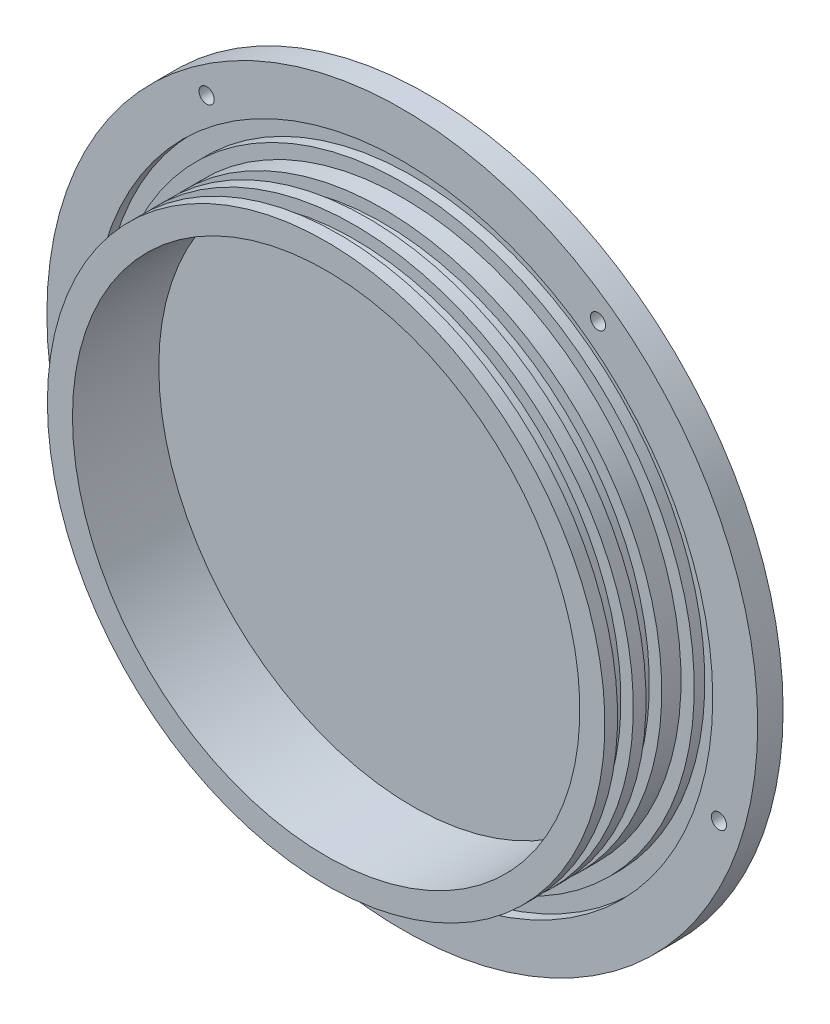
ISO-10303-21;
HEADER;
FILE_DESCRIPTION(('STEP AP214'),'2;1');
FILE_NAME('part.step','',(''),(''),'','','');
FILE_SCHEMA(('AUTOMOTIVE_DESIGN { 1 0 10303 214 1 1 1 1 }'));
ENDSEC;
DATA;
#1=APPLICATION_CONTEXT('core data for automotive mechanical design processes');
#2=APPLICATION_PROTOCOL_DEFINITION('international standard','automotive_design',2000,#1);
#3=PRODUCT_CONTEXT('',#1,'mechanical');
#4=PRODUCT('Part','Part','',(#3));
#5=PRODUCT_RELATED_PRODUCT_CATEGORY('part','',(#4));
#6=PRODUCT_DEFINITION_FORMATION('','',#4);
#7=PRODUCT_DEFINITION_CONTEXT('part definition',#1,'design');
#8=PRODUCT_DEFINITION('design','',#6,#7);
#9=PRODUCT_DEFINITION_SHAPE('','',#8);
#10=(LENGTH_UNIT() NAMED_UNIT(*) SI_UNIT(.MILLI.,.METRE.));
#11=(NAMED_UNIT(*) PLANE_ANGLE_UNIT() SI_UNIT($,.RADIAN.));
#12=(NAMED_UNIT(*) SI_UNIT($,.STERADIAN.) SOLID_ANGLE_UNIT());
#13=UNCERTAINTY_MEASURE_WITH_UNIT(LENGTH_MEASURE(1.E-05),#10,'distance_accuracy_value','');
#14=(GEOMETRIC_REPRESENTATION_CONTEXT(3) GLOBAL_UNCERTAINTY_ASSIGNED_CONTEXT((#13)) GLOBAL_UNIT_ASSIGNED_CONTEXT((#10,
#11,#12)) REPRESENTATION_CONTEXT('',''));
#15=CARTESIAN_POINT('',(0.,0.,0.));
#16=DIRECTION('',(0.,0.,1.));
#17=DIRECTION('',(1.,0.,0.));
#18=AXIS2_PLACEMENT_3D('',#15,#16,#17);
#19=CARTESIAN_POINT('',(0.,0.,0.));
#20=DIRECTION('',(0.,0.,1.));
#21=DIRECTION('',(1.,0.,0.));
#22=AXIS2_PLACEMENT_3D('',#19,#20,#21);
#23=PLANE('',#22);
#24=CARTESIAN_POINT('',(0.,-83.2739,0.));
#25=DIRECTION('',(0.,0.,1.));
#26=DIRECTION('',(1.,0.,0.));
#27=AXIS2_PLACEMENT_3D('',#24,#25,#26);
#28=CIRCLE('',#27,1.89864999999999);
#29=CARTESIAN_POINT('',(1.89864999999999,-83.2739,0.));
#30=VERTEX_POINT('',#29);
#31=EDGE_CURVE('E118',#30,#30,#28,.T.);
#32=ORIENTED_EDGE('',*,*,#31,.T.);
#33=EDGE_LOOP('',(#32));
#34=FACE_BOUND('',#33,.T.);
#35=CARTESIAN_POINT('',(79.1981852323111,-25.7330502878797,0.));
#36=DIRECTION('',(0.,0.,1.));
#37=DIRECTION('',(1.,0.,0.));
#38=AXIS2_PLACEMENT_3D('',#35,#36,#37);
#39=CIRCLE('',#38,1.89864999999999);
#40=CARTESIAN_POINT('',(81.0968352323111,-25.7330502878797,0.));
#41=VERTEX_POINT('',#40);
#42=EDGE_CURVE('E112',#41,#41,#39,.T.);
#43=ORIENTED_EDGE('',*,*,#42,.T.);
#44=EDGE_LOOP('',(#43));
#45=FACE_BOUND('',#44,.T.);
#46=CARTESIAN_POINT('',(48.9471703208778,67.3700002878802,0.));
#47=DIRECTION('',(0.,0.,1.));
#48=DIRECTION('',(1.,0.,0.));
#49=AXIS2_PLACEMENT_3D('',#46,#47,#48);
#50=CIRCLE('',#49,1.89864999999999);
#51=CARTESIAN_POINT('',(50.8458203208778,67.3700002878802,0.));
#52=VERTEX_POINT('',#51);
#53=EDGE_CURVE('E106',#52,#52,#50,.T.);
#54=ORIENTED_EDGE('',*,*,#53,.T.);
#55=EDGE_LOOP('',(#54));
#56=FACE_BOUND('',#55,.T.);
#57=CARTESIAN_POINT('',(-79.1981852323111,-25.7330502878797,0.));
#58=DIRECTION('',(0.,0.,1.));
#59=DIRECTION('',(1.,0.,0.));
#60=AXIS2_PLACEMENT_3D('',#57,#58,#59);
#61=CIRCLE('',#60,1.89864999999999);
#62=CARTESIAN_POINT('',(-77.2995352323111,-25.7330502878797,0.));
#63=VERTEX_POINT('',#62);
#64=EDGE_CURVE('E100',#63,#63,#61,.T.);
#65=ORIENTED_EDGE('',*,*,#64,.T.);
#66=EDGE_LOOP('',(#65));
#67=FACE_BOUND('',#66,.T.);
#68=CARTESIAN_POINT('',(-48.9471703208778,67.3700002878802,0.));
#69=DIRECTION('',(0.,0.,1.));
#70=DIRECTION('',(1.,0.,0.));
#71=AXIS2_PLACEMENT_3D('',#68,#69,#70);
#72=CIRCLE('',#71,1.89864999999999);
#73=CARTESIAN_POINT('',(-47.0485203208778,67.3700002878802,0.));
#74=VERTEX_POINT('',#73);
#75=EDGE_CURVE('E94',#74,#74,#72,.T.);
#76=ORIENTED_EDGE('',*,*,#75,.T.);
#77=EDGE_LOOP('',(#76));
#78=FACE_BOUND('',#77,.T.);
#79=CARTESIAN_POINT('',(0.,0.,0.));
#80=DIRECTION('',(0.,0.,-1.));
#81=DIRECTION('',(-1.,0.,0.));
#82=AXIS2_PLACEMENT_3D('',#79,#80,#81);
#83=CIRCLE('',#82,88.9);
#84=CARTESIAN_POINT('',(-88.9,0.,0.));
#85=VERTEX_POINT('',#84);
#86=EDGE_CURVE('E10',#85,#85,#83,.T.);
#87=ORIENTED_EDGE('',*,*,#86,.T.);
#88=EDGE_LOOP('',(#87));
#89=FACE_BOUND('',#88,.T.);
#90=ADVANCED_FACE('F33',(#34,#45,#56,#67,#78,#89),#23,.F.);
#91=CARTESIAN_POINT('',(0.,0.,0.));
#92=DIRECTION('',(0.,0.,-1.));
#93=DIRECTION('',(-1.,0.,0.));
#94=AXIS2_PLACEMENT_3D('',#91,#92,#93);
#95=CYLINDRICAL_SURFACE('',#94,88.9);
#96=ORIENTED_EDGE('',*,*,#86,.F.);
#97=EDGE_LOOP('',(#96));
#98=FACE_BOUND('',#97,.T.);
#99=CARTESIAN_POINT('',(0.,0.,6.35));
#100=DIRECTION('',(0.,0.,-1.));
#101=DIRECTION('',(-1.,0.,0.));
#102=AXIS2_PLACEMENT_3D('',#99,#100,#101);
#103=CIRCLE('',#102,88.9);
#104=CARTESIAN_POINT('',(-88.9,0.,6.35));
#105=VERTEX_POINT('',#104);
#106=EDGE_CURVE('E39',#105,#105,#103,.T.);
#107=ORIENTED_EDGE('',*,*,#106,.T.);
#108=EDGE_LOOP('',(#107));
#109=FACE_BOUND('',#108,.T.);
#110=ADVANCED_FACE('F132',(#98,#109),#95,.T.);
#111=CARTESIAN_POINT('',(77.6478,0.,6.35));
#112=DIRECTION('',(0.,0.,-1.));
#113=DIRECTION('',(-1.,0.,0.));
#114=AXIS2_PLACEMENT_3D('',#111,#112,#113);
#115=PLANE('',#114);
#116=CARTESIAN_POINT('',(0.,-83.2739,6.35));
#117=DIRECTION('',(0.,0.,1.));
#118=DIRECTION('',(1.,0.,0.));
#119=AXIS2_PLACEMENT_3D('',#116,#117,#118);
#120=CIRCLE('',#119,1.89864999999999);
#121=CARTESIAN_POINT('',(1.89864999999999,-83.2739,6.35));
#122=VERTEX_POINT('',#121);
#123=EDGE_CURVE('E121',#122,#122,#120,.T.);
#124=ORIENTED_EDGE('',*,*,#123,.F.);
#125=EDGE_LOOP('',(#124));
#126=FACE_BOUND('',#125,.T.);
#127=CARTESIAN_POINT('',(79.1981852323111,-25.7330502878797,6.35));
#128=DIRECTION('',(0.,0.,1.));
#129=DIRECTION('',(1.,0.,0.));
#130=AXIS2_PLACEMENT_3D('',#127,#128,#129);
#131=CIRCLE('',#130,1.89864999999999);
#132=CARTESIAN_POINT('',(81.0968352323111,-25.7330502878797,6.35));
#133=VERTEX_POINT('',#132);
#134=EDGE_CURVE('E115',#133,#133,#131,.T.);
#135=ORIENTED_EDGE('',*,*,#134,.F.);
#136=EDGE_LOOP('',(#135));
#137=FACE_BOUND('',#136,.T.);
#138=CARTESIAN_POINT('',(48.9471703208778,67.3700002878802,6.35));
#139=DIRECTION('',(0.,0.,1.));
#140=DIRECTION('',(1.,0.,0.));
#141=AXIS2_PLACEMENT_3D('',#138,#139,#140);
#142=CIRCLE('',#141,1.89864999999999);
#143=CARTESIAN_POINT('',(50.8458203208778,67.3700002878802,6.35));
#144=VERTEX_POINT('',#143);
#145=EDGE_CURVE('E109',#144,#144,#142,.T.);
#146=ORIENTED_EDGE('',*,*,#145,.F.);
#147=EDGE_LOOP('',(#146));
#148=FACE_BOUND('',#147,.T.);
#149=CARTESIAN_POINT('',(-79.1981852323111,-25.7330502878797,6.35));
#150=DIRECTION('',(0.,0.,1.));
#151=DIRECTION('',(1.,0.,0.));
#152=AXIS2_PLACEMENT_3D('',#149,#150,#151);
#153=CIRCLE('',#152,1.89864999999999);
#154=CARTESIAN_POINT('',(-77.2995352323111,-25.7330502878797,6.35));
#155=VERTEX_POINT('',#154);
#156=EDGE_CURVE('E103',#155,#155,#153,.T.);
#157=ORIENTED_EDGE('',*,*,#156,.F.);
#158=EDGE_LOOP('',(#157));
#159=FACE_BOUND('',#158,.T.);
#160=CARTESIAN_POINT('',(-48.9471703208778,67.3700002878802,6.35));
#161=DIRECTION('',(0.,0.,1.));
#162=DIRECTION('',(1.,0.,0.));
#163=AXIS2_PLACEMENT_3D('',#160,#161,#162);
#164=CIRCLE('',#163,1.89864999999999);
#165=CARTESIAN_POINT('',(-47.0485203208778,67.3700002878802,6.35));
#166=VERTEX_POINT('',#165);
#167=EDGE_CURVE('E97',#166,#166,#164,.T.);
#168=ORIENTED_EDGE('',*,*,#167,.F.);
#169=EDGE_LOOP('',(#168));
#170=FACE_BOUND('',#169,.T.);
#171=ORIENTED_EDGE('',*,*,#106,.F.);
#172=EDGE_LOOP('',(#171));
#173=FACE_BOUND('',#172,.T.);
#174=CARTESIAN_POINT('',(0.,0.,6.35));
#175=DIRECTION('',(0.,0.,-1.));
#176=DIRECTION('',(-1.,0.,0.));
#177=AXIS2_PLACEMENT_3D('',#174,#175,#176);
#178=CIRCLE('',#177,77.6478);
#179=CARTESIAN_POINT('',(-77.6478,0.,6.35));
#180=VERTEX_POINT('',#179);
#181=EDGE_CURVE('E43',#180,#180,#178,.T.);
#182=ORIENTED_EDGE('',*,*,#181,.T.);
#183=EDGE_LOOP('',(#182));
#184=FACE_BOUND('',#183,.T.);
#185=ADVANCED_FACE('F128',(#126,#137,#148,#159,#170,#173,#184),#115,.F.);
#186=CARTESIAN_POINT('',(0.,0.,0.));
#187=DIRECTION('',(0.,0.,-1.));
#188=DIRECTION('',(-1.,0.,0.));
#189=AXIS2_PLACEMENT_3D('',#186,#187,#188);
#190=CYLINDRICAL_SURFACE('',#189,77.6478);
#191=ORIENTED_EDGE('',*,*,#181,.F.);
#192=EDGE_LOOP('',(#191));
#193=FACE_BOUND('',#192,.T.);
#194=CARTESIAN_POINT('',(0.,0.,3.7084));
#195=DIRECTION('',(0.,0.,-1.));
#196=DIRECTION('',(-1.,0.,0.));
#197=AXIS2_PLACEMENT_3D('',#194,#195,#196);
#198=CIRCLE('',#197,77.6478);
#199=CARTESIAN_POINT('',(-77.6478,0.,3.7084));
#200=VERTEX_POINT('',#199);
#201=EDGE_CURVE('E47',#200,#200,#198,.T.);
#202=ORIENTED_EDGE('',*,*,#201,.T.);
#203=EDGE_LOOP('',(#202));
#204=FACE_BOUND('',#203,.T.);
#205=ADVANCED_FACE('F131',(#193,#204),#190,.F.);
#206=CARTESIAN_POINT('',(73.025,0.,3.7084));
#207=DIRECTION('',(0.,0.,-1.));
#208=DIRECTION('',(-1.,0.,0.));
#209=AXIS2_PLACEMENT_3D('',#206,#207,#208);
#210=PLANE('',#209);
#211=ORIENTED_EDGE('',*,*,#201,.F.);
#212=EDGE_LOOP('',(#211));
#213=FACE_BOUND('',#212,.T.);
#214=CARTESIAN_POINT('',(0.,0.,3.7084));
#215=DIRECTION('',(0.,0.,-1.));
#216=DIRECTION('',(-1.,0.,0.));
#217=AXIS2_PLACEMENT_3D('',#214,#215,#216);
#218=CIRCLE('',#217,73.025);
#219=CARTESIAN_POINT('',(-73.025,0.,3.7084));
#220=VERTEX_POINT('',#219);
#221=EDGE_CURVE('E52',#220,#220,#218,.T.);
#222=ORIENTED_EDGE('',*,*,#221,.T.);
#223=EDGE_LOOP('',(#222));
#224=FACE_BOUND('',#223,.T.);
#225=ADVANCED_FACE('F147',(#213,#224),#210,.F.);
#226=CARTESIAN_POINT('',(0.,0.,0.));
#227=DIRECTION('',(0.,0.,-1.));
#228=DIRECTION('',(-1.,0.,0.));
#229=AXIS2_PLACEMENT_3D('',#226,#227,#228);
#230=CYLINDRICAL_SURFACE('',#229,73.025);
#231=ORIENTED_EDGE('',*,*,#221,.F.);
#232=EDGE_LOOP('',(#231));
#233=FACE_BOUND('',#232,.T.);
#234=CARTESIAN_POINT('',(0.,0.,6.35));
#235=DIRECTION('',(0.,0.,-1.));
#236=DIRECTION('',(-1.,0.,0.));
#237=AXIS2_PLACEMENT_3D('',#234,#235,#236);
#238=CIRCLE('',#237,73.025);
#239=CARTESIAN_POINT('',(-73.025,0.,6.35));
#240=VERTEX_POINT('',#239);
#241=EDGE_CURVE('E55',#240,#240,#238,.T.);
#242=ORIENTED_EDGE('',*,*,#241,.T.);
#243=EDGE_LOOP('',(#242));
#244=FACE_BOUND('',#243,.T.);
#245=ADVANCED_FACE('F153',(#233,#244),#230,.T.);
#246=CARTESIAN_POINT('',(73.025,0.,6.35));
#247=DIRECTION('',(0.,0.,-1.));
#248=DIRECTION('',(-1.,0.,0.));
#249=AXIS2_PLACEMENT_3D('',#246,#247,#248);
#250=PLANE('',#249);
#251=ORIENTED_EDGE('',*,*,#241,.F.);
#252=EDGE_LOOP('',(#251));
#253=FACE_BOUND('',#252,.T.);
#254=CARTESIAN_POINT('',(0.,0.,6.35));
#255=DIRECTION('',(0.,0.,-1.));
#256=DIRECTION('',(-1.,0.,0.));
#257=AXIS2_PLACEMENT_3D('',#254,#255,#256);
#258=CIRCLE('',#257,69.723);
#259=CARTESIAN_POINT('',(-69.723,0.,6.35));
#260=VERTEX_POINT('',#259);
#261=EDGE_CURVE('E58',#260,#260,#258,.T.);
#262=ORIENTED_EDGE('',*,*,#261,.T.);
#263=EDGE_LOOP('',(#262));
#264=FACE_BOUND('',#263,.T.);
#265=ADVANCED_FACE('F159',(#253,#264),#250,.F.);
#266=CARTESIAN_POINT('',(0.,0.,0.));
#267=DIRECTION('',(0.,0.,-1.));
#268=DIRECTION('',(-1.,0.,0.));
#269=AXIS2_PLACEMENT_3D('',#266,#267,#268);
#270=CYLINDRICAL_SURFACE('',#269,69.723);
#271=ORIENTED_EDGE('',*,*,#261,.F.);
#272=EDGE_LOOP('',(#271));
#273=FACE_BOUND('',#272,.T.);
#274=CARTESIAN_POINT('',(0.,0.,11.176));
#275=DIRECTION('',(0.,0.,-1.));
#276=DIRECTION('',(-1.,0.,0.));
#277=AXIS2_PLACEMENT_3D('',#274,#275,#276);
#278=CIRCLE('',#277,69.723);
#279=CARTESIAN_POINT('',(-69.723,0.,11.176));
#280=VERTEX_POINT('',#279);
#281=EDGE_CURVE('E61',#280,#280,#278,.T.);
#282=ORIENTED_EDGE('',*,*,#281,.T.);
#283=EDGE_LOOP('',(#282));
#284=FACE_BOUND('',#283,.T.);
#285=ADVANCED_FACE('F165',(#273,#284),#270,.T.);
#286=CARTESIAN_POINT('',(66.6242,0.,11.176));
#287=DIRECTION('',(0.,0.,-1.));
#288=DIRECTION('',(-1.,0.,0.));
#289=AXIS2_PLACEMENT_3D('',#286,#287,#288);
#290=PLANE('',#289);
#291=ORIENTED_EDGE('',*,*,#281,.F.);
#292=EDGE_LOOP('',(#291));
#293=FACE_BOUND('',#292,.T.);
#294=CARTESIAN_POINT('',(0.,0.,11.176));
#295=DIRECTION('',(0.,0.,-1.));
#296=DIRECTION('',(-1.,0.,0.));
#297=AXIS2_PLACEMENT_3D('',#294,#295,#296);
#298=CIRCLE('',#297,66.6242);
#299=CARTESIAN_POINT('',(-66.6242,0.,11.176));
#300=VERTEX_POINT('',#299);
#301=EDGE_CURVE('E64',#300,#300,#298,.T.);
#302=ORIENTED_EDGE('',*,*,#301,.T.);
#303=EDGE_LOOP('',(#302));
#304=FACE_BOUND('',#303,.T.);
#305=ADVANCED_FACE('F171',(#293,#304),#290,.F.);
#306=CARTESIAN_POINT('',(0.,0.,0.));
#307=DIRECTION('',(0.,0.,-1.));
#308=DIRECTION('',(-1.,0.,0.));
#309=AXIS2_PLACEMENT_3D('',#306,#307,#308);
#310=CYLINDRICAL_SURFACE('',#309,66.6242);
#311=ORIENTED_EDGE('',*,*,#301,.F.);
#312=EDGE_LOOP('',(#311));
#313=FACE_BOUND('',#312,.T.);
#314=CARTESIAN_POINT('',(0.,0.,15.113));
#315=DIRECTION('',(0.,0.,-1.));
#316=DIRECTION('',(-1.,0.,0.));
#317=AXIS2_PLACEMENT_3D('',#314,#315,#316);
#318=CIRCLE('',#317,66.6242);
#319=CARTESIAN_POINT('',(-66.6242,0.,15.113));
#320=VERTEX_POINT('',#319);
#321=EDGE_CURVE('E67',#320,#320,#318,.T.);
#322=ORIENTED_EDGE('',*,*,#321,.T.);
#323=EDGE_LOOP('',(#322));
#324=FACE_BOUND('',#323,.T.);
#325=ADVANCED_FACE('F177',(#313,#324),#310,.T.);
#326=CARTESIAN_POINT('',(69.723,0.,15.113));
#327=DIRECTION('',(0.,0.,1.));
#328=DIRECTION('',(1.,0.,0.));
#329=AXIS2_PLACEMENT_3D('',#326,#327,#328);
#330=PLANE('',#329);
#331=ORIENTED_EDGE('',*,*,#321,.F.);
#332=EDGE_LOOP('',(#331));
#333=FACE_BOUND('',#332,.T.);
#334=CARTESIAN_POINT('',(0.,0.,15.113));
#335=DIRECTION('',(0.,0.,-1.));
#336=DIRECTION('',(-1.,0.,0.));
#337=AXIS2_PLACEMENT_3D('',#334,#335,#336);
#338=CIRCLE('',#337,69.723);
#339=CARTESIAN_POINT('',(-69.723,0.,15.113));
#340=VERTEX_POINT('',#339);
#341=EDGE_CURVE('E70',#340,#340,#338,.T.);
#342=ORIENTED_EDGE('',*,*,#341,.T.);
#343=EDGE_LOOP('',(#342));
#344=FACE_BOUND('',#343,.T.);
#345=ADVANCED_FACE('F183',(#333,#344),#330,.F.);
#346=CARTESIAN_POINT('',(0.,0.,0.));
#347=DIRECTION('',(0.,0.,-1.));
#348=DIRECTION('',(-1.,0.,0.));
#349=AXIS2_PLACEMENT_3D('',#346,#347,#348);
#350=CYLINDRICAL_SURFACE('',#349,69.723);
#351=ORIENTED_EDGE('',*,*,#341,.F.);
#352=EDGE_LOOP('',(#351));
#353=FACE_BOUND('',#352,.T.);
#354=CARTESIAN_POINT('',(0.,0.,18.288));
#355=DIRECTION('',(0.,0.,-1.));
#356=DIRECTION('',(-1.,0.,0.));
#357=AXIS2_PLACEMENT_3D('',#354,#355,#356);
#358=CIRCLE('',#357,69.723);
#359=CARTESIAN_POINT('',(-69.723,0.,18.288));
#360=VERTEX_POINT('',#359);
#361=EDGE_CURVE('E73',#360,#360,#358,.T.);
#362=ORIENTED_EDGE('',*,*,#361,.T.);
#363=EDGE_LOOP('',(#362));
#364=FACE_BOUND('',#363,.T.);
#365=ADVANCED_FACE('F189',(#353,#364),#350,.T.);
#366=CARTESIAN_POINT('',(66.6242,0.,18.288));
#367=DIRECTION('',(0.,0.,-1.));
#368=DIRECTION('',(-1.,0.,0.));
#369=AXIS2_PLACEMENT_3D('',#366,#367,#368);
#370=PLANE('',#369);
#371=ORIENTED_EDGE('',*,*,#361,.F.);
#372=EDGE_LOOP('',(#371));
#373=FACE_BOUND('',#372,.T.);
#374=CARTESIAN_POINT('',(0.,0.,18.288));
#375=DIRECTION('',(0.,0.,-1.));
#376=DIRECTION('',(-1.,0.,0.));
#377=AXIS2_PLACEMENT_3D('',#374,#375,#376);
#378=CIRCLE('',#377,66.6242);
#379=CARTESIAN_POINT('',(-66.6242,0.,18.288));
#380=VERTEX_POINT('',#379);
#381=EDGE_CURVE('E76',#380,#380,#378,.T.);
#382=ORIENTED_EDGE('',*,*,#381,.T.);
#383=EDGE_LOOP('',(#382));
#384=FACE_BOUND('',#383,.T.);
#385=ADVANCED_FACE('F195',(#373,#384),#370,.F.);
#386=CARTESIAN_POINT('',(0.,0.,0.));
#387=DIRECTION('',(0.,0.,-1.));
#388=DIRECTION('',(-1.,0.,0.));
#389=AXIS2_PLACEMENT_3D('',#386,#387,#388);
#390=CYLINDRICAL_SURFACE('',#389,66.6242);
#391=ORIENTED_EDGE('',*,*,#381,.F.);
#392=EDGE_LOOP('',(#391));
#393=FACE_BOUND('',#392,.T.);
#394=CARTESIAN_POINT('',(0.,0.,22.225));
#395=DIRECTION('',(0.,0.,-1.));
#396=DIRECTION('',(-1.,0.,0.));
#397=AXIS2_PLACEMENT_3D('',#394,#395,#396);
#398=CIRCLE('',#397,66.6242);
#399=CARTESIAN_POINT('',(-66.6242,0.,22.225));
#400=VERTEX_POINT('',#399);
#401=EDGE_CURVE('E79',#400,#400,#398,.T.);
#402=ORIENTED_EDGE('',*,*,#401,.T.);
#403=EDGE_LOOP('',(#402));
#404=FACE_BOUND('',#403,.T.);
#405=ADVANCED_FACE('F201',(#393,#404),#390,.T.);
#406=CARTESIAN_POINT('',(69.723,0.,22.225));
#407=DIRECTION('',(0.,0.,1.));
#408=DIRECTION('',(1.,0.,0.));
#409=AXIS2_PLACEMENT_3D('',#406,#407,#408);
#410=PLANE('',#409);
#411=ORIENTED_EDGE('',*,*,#401,.F.);
#412=EDGE_LOOP('',(#411));
#413=FACE_BOUND('',#412,.T.);
#414=CARTESIAN_POINT('',(0.,0.,22.225));
#415=DIRECTION('',(0.,0.,-1.));
#416=DIRECTION('',(-1.,0.,0.));
#417=AXIS2_PLACEMENT_3D('',#414,#415,#416);
#418=CIRCLE('',#417,69.723);
#419=CARTESIAN_POINT('',(-69.723,0.,22.225));
#420=VERTEX_POINT('',#419);
#421=EDGE_CURVE('E82',#420,#420,#418,.T.);
#422=ORIENTED_EDGE('',*,*,#421,.T.);
#423=EDGE_LOOP('',(#422));
#424=FACE_BOUND('',#423,.T.);
#425=ADVANCED_FACE('F207',(#413,#424),#410,.F.);
#426=CARTESIAN_POINT('',(0.,0.,0.));
#427=DIRECTION('',(0.,0.,-1.));
#428=DIRECTION('',(-1.,0.,0.));
#429=AXIS2_PLACEMENT_3D('',#426,#427,#428);
#430=CYLINDRICAL_SURFACE('',#429,69.723);
#431=ORIENTED_EDGE('',*,*,#421,.F.);
#432=EDGE_LOOP('',(#431));
#433=FACE_BOUND('',#432,.T.);
#434=CARTESIAN_POINT('',(0.,0.,25.4));
#435=DIRECTION('',(0.,0.,-1.));
#436=DIRECTION('',(-1.,0.,0.));
#437=AXIS2_PLACEMENT_3D('',#434,#435,#436);
#438=CIRCLE('',#437,69.723);
#439=CARTESIAN_POINT('',(-69.723,0.,25.4));
#440=VERTEX_POINT('',#439);
#441=EDGE_CURVE('E85',#440,#440,#438,.T.);
#442=ORIENTED_EDGE('',*,*,#441,.T.);
#443=EDGE_LOOP('',(#442));
#444=FACE_BOUND('',#443,.T.);
#445=ADVANCED_FACE('F213',(#433,#444),#430,.T.);
#446=CARTESIAN_POINT('',(63.4492,0.,25.4));
#447=DIRECTION('',(0.,0.,-1.));
#448=DIRECTION('',(-1.,0.,0.));
#449=AXIS2_PLACEMENT_3D('',#446,#447,#448);
#450=PLANE('',#449);
#451=ORIENTED_EDGE('',*,*,#441,.F.);
#452=EDGE_LOOP('',(#451));
#453=FACE_BOUND('',#452,.T.);
#454=CARTESIAN_POINT('',(0.,0.,25.4));
#455=DIRECTION('',(0.,0.,-1.));
#456=DIRECTION('',(-1.,0.,0.));
#457=AXIS2_PLACEMENT_3D('',#454,#455,#456);
#458=CIRCLE('',#457,63.4492);
#459=CARTESIAN_POINT('',(-63.4492,0.,25.4));
#460=VERTEX_POINT('',#459);
#461=EDGE_CURVE('E88',#460,#460,#458,.T.);
#462=ORIENTED_EDGE('',*,*,#461,.T.);
#463=EDGE_LOOP('',(#462));
#464=FACE_BOUND('',#463,.T.);
#465=ADVANCED_FACE('F219',(#453,#464),#450,.F.);
#466=CARTESIAN_POINT('',(0.,0.,0.));
#467=DIRECTION('',(0.,0.,-1.));
#468=DIRECTION('',(-1.,0.,0.));
#469=AXIS2_PLACEMENT_3D('',#466,#467,#468);
#470=CYLINDRICAL_SURFACE('',#469,63.4492);
#471=ORIENTED_EDGE('',*,*,#461,.F.);
#472=EDGE_LOOP('',(#471));
#473=FACE_BOUND('',#472,.T.);
#474=CARTESIAN_POINT('',(0.,0.,3.81180993664465));
#475=DIRECTION('',(0.,0.,-1.));
#476=DIRECTION('',(-1.,0.,0.));
#477=AXIS2_PLACEMENT_3D('',#474,#475,#476);
#478=CIRCLE('',#477,63.4492);
#479=CARTESIAN_POINT('',(-63.4492,0.,3.81180993664465));
#480=VERTEX_POINT('',#479);
#481=EDGE_CURVE('E91',#480,#480,#478,.T.);
#482=ORIENTED_EDGE('',*,*,#481,.T.);
#483=EDGE_LOOP('',(#482));
#484=FACE_BOUND('',#483,.T.);
#485=ADVANCED_FACE('F225',(#473,#484),#470,.F.);
#486=CARTESIAN_POINT('',(63.4492,0.,3.81180993664466));
#487=DIRECTION('',(0.,0.,-1.));
#488=DIRECTION('',(-1.,0.,0.));
#489=AXIS2_PLACEMENT_3D('',#486,#487,#488);
#490=PLANE('',#489);
#491=ORIENTED_EDGE('',*,*,#481,.F.);
#492=EDGE_LOOP('',(#491));
#493=FACE_BOUND('',#492,.T.);
#494=ADVANCED_FACE('F231',(#493),#490,.F.);
#495=CARTESIAN_POINT('',(-48.9471703208778,67.3700002878802,6.35));
#496=DIRECTION('',(0.,0.,1.));
#497=DIRECTION('',(1.,0.,0.));
#498=AXIS2_PLACEMENT_3D('',#495,#496,#497);
#499=CYLINDRICAL_SURFACE('',#498,1.89864999999999);
#500=ORIENTED_EDGE('',*,*,#167,.T.);
#501=EDGE_LOOP('',(#500));
#502=FACE_BOUND('',#501,.T.);
#503=ORIENTED_EDGE('',*,*,#75,.F.);
#504=EDGE_LOOP('',(#503));
#505=FACE_BOUND('',#504,.T.);
#506=ADVANCED_FACE('F236',(#502,#505),#499,.F.);
#507=CARTESIAN_POINT('',(-79.1981852323111,-25.7330502878797,6.35));
#508=DIRECTION('',(0.,0.,1.));
#509=DIRECTION('',(1.,0.,0.));
#510=AXIS2_PLACEMENT_3D('',#507,#508,#509);
#511=CYLINDRICAL_SURFACE('',#510,1.89864999999999);
#512=ORIENTED_EDGE('',*,*,#156,.T.);
#513=EDGE_LOOP('',(#512));
#514=FACE_BOUND('',#513,.T.);
#515=ORIENTED_EDGE('',*,*,#64,.F.);
#516=EDGE_LOOP('',(#515));
#517=FACE_BOUND('',#516,.T.);
#518=ADVANCED_FACE('F241',(#514,#517),#511,.F.);
#519=CARTESIAN_POINT('',(48.9471703208778,67.3700002878802,6.35));
#520=DIRECTION('',(0.,0.,1.));
#521=DIRECTION('',(1.,0.,0.));
#522=AXIS2_PLACEMENT_3D('',#519,#520,#521);
#523=CYLINDRICAL_SURFACE('',#522,1.89864999999999);
#524=ORIENTED_EDGE('',*,*,#145,.T.);
#525=EDGE_LOOP('',(#524));
#526=FACE_BOUND('',#525,.T.);
#527=ORIENTED_EDGE('',*,*,#53,.F.);
#528=EDGE_LOOP('',(#527));
#529=FACE_BOUND('',#528,.T.);
#530=ADVANCED_FACE('F262',(#526,#529),#523,.F.);
#531=CARTESIAN_POINT('',(79.1981852323111,-25.7330502878797,6.35));
#532=DIRECTION('',(0.,0.,1.));
#533=DIRECTION('',(1.,0.,0.));
#534=AXIS2_PLACEMENT_3D('',#531,#532,#533);
#535=CYLINDRICAL_SURFACE('',#534,1.89864999999999);
#536=ORIENTED_EDGE('',*,*,#134,.T.);
#537=EDGE_LOOP('',(#536));
#538=FACE_BOUND('',#537,.T.);
#539=ORIENTED_EDGE('',*,*,#42,.F.);
#540=EDGE_LOOP('',(#539));
#541=FACE_BOUND('',#540,.T.);
#542=ADVANCED_FACE('F268',(#538,#541),#535,.F.);
#543=CARTESIAN_POINT('',(0.,-83.2739,6.35));
#544=DIRECTION('',(0.,0.,1.));
#545=DIRECTION('',(1.,0.,0.));
#546=AXIS2_PLACEMENT_3D('',#543,#544,#545);
#547=CYLINDRICAL_SURFACE('',#546,1.89864999999999);
#548=ORIENTED_EDGE('',*,*,#123,.T.);
#549=EDGE_LOOP('',(#548));
#550=FACE_BOUND('',#549,.T.);
#551=ORIENTED_EDGE('',*,*,#31,.F.);
#552=EDGE_LOOP('',(#551));
#553=FACE_BOUND('',#552,.T.);
#554=ADVANCED_FACE('F125',(#550,#553),#547,.F.);
#555=CLOSED_SHELL('',(#90,#110,#185,#205,#225,#245,#265,#285,#305,#325,#345,#365,#385,#405,#425,
#445,#465,#485,#494,#506,#518,#530,#542,#554));
#556=MANIFOLD_SOLID_BREP('B2',#555);
#557=ADVANCED_BREP_SHAPE_REPRESENTATION('',(#18,#556),#14);
#558=SHAPE_DEFINITION_REPRESENTATION(#9,#557);
ENDSEC;
END-ISO-10303-21;
